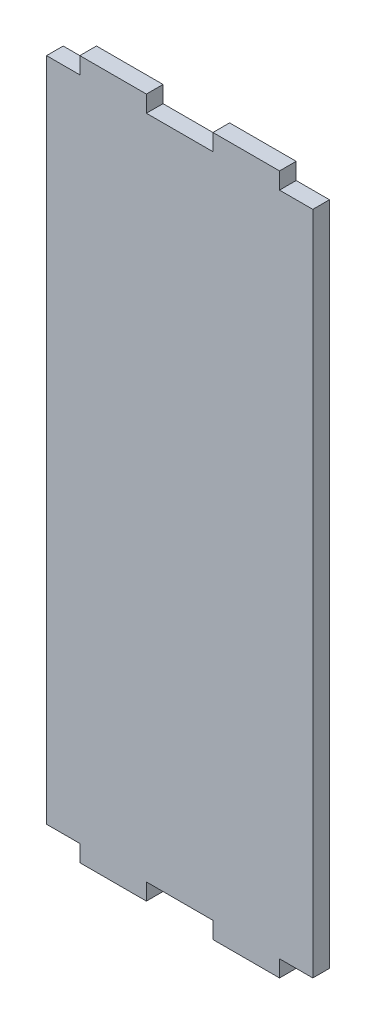
ISO-10303-21;
HEADER;
FILE_DESCRIPTION(('STEP AP214'),'2;1');
FILE_NAME('part.step','',(''),(''),'','','');
FILE_SCHEMA(('AUTOMOTIVE_DESIGN { 1 0 10303 214 1 1 1 1 }'));
ENDSEC;
DATA;
#1=APPLICATION_CONTEXT('core data for automotive mechanical design processes');
#2=APPLICATION_PROTOCOL_DEFINITION('international standard','automotive_design',2000,#1);
#3=PRODUCT_CONTEXT('',#1,'mechanical');
#4=PRODUCT('Part','Part','',(#3));
#5=PRODUCT_RELATED_PRODUCT_CATEGORY('part','',(#4));
#6=PRODUCT_DEFINITION_FORMATION('','',#4);
#7=PRODUCT_DEFINITION_CONTEXT('part definition',#1,'design');
#8=PRODUCT_DEFINITION('design','',#6,#7);
#9=PRODUCT_DEFINITION_SHAPE('','',#8);
#10=(LENGTH_UNIT() NAMED_UNIT(*) SI_UNIT(.MILLI.,.METRE.));
#11=(NAMED_UNIT(*) PLANE_ANGLE_UNIT() SI_UNIT($,.RADIAN.));
#12=(NAMED_UNIT(*) SI_UNIT($,.STERADIAN.) SOLID_ANGLE_UNIT());
#13=UNCERTAINTY_MEASURE_WITH_UNIT(LENGTH_MEASURE(1.E-05),#10,'distance_accuracy_value','');
#14=(GEOMETRIC_REPRESENTATION_CONTEXT(3) GLOBAL_UNCERTAINTY_ASSIGNED_CONTEXT((#13)) GLOBAL_UNIT_ASSIGNED_CONTEXT((#10,
#11,#12)) REPRESENTATION_CONTEXT('',''));
#15=CARTESIAN_POINT('',(0.,0.,0.));
#16=DIRECTION('',(0.,0.,1.));
#17=DIRECTION('',(1.,0.,0.));
#18=AXIS2_PLACEMENT_3D('',#15,#16,#17);
#19=CARTESIAN_POINT('',(0.,0.,5.));
#20=DIRECTION('',(0.,1.,0.));
#21=DIRECTION('',(-1.,0.,0.));
#22=AXIS2_PLACEMENT_3D('',#19,#20,#21);
#23=PLANE('',#22);
#24=DIRECTION('',(1.,0.,0.));
#25=VECTOR('',#24,1.);
#26=CARTESIAN_POINT('',(0.,0.,5.));
#27=LINE('',#26,#25);
#28=CARTESIAN_POINT('',(-10.,0.,5.));
#29=VERTEX_POINT('',#28);
#30=CARTESIAN_POINT('',(0.,0.,5.));
#31=VERTEX_POINT('',#30);
#32=EDGE_CURVE('E49',#29,#31,#27,.T.);
#33=ORIENTED_EDGE('',*,*,#32,.F.);
#34=DIRECTION('',(0.,0.,1.));
#35=VECTOR('',#34,1.);
#36=CARTESIAN_POINT('',(-10.,0.,0.));
#37=LINE('',#36,#35);
#38=CARTESIAN_POINT('',(-10.,0.,0.));
#39=VERTEX_POINT('',#38);
#40=EDGE_CURVE('E205',#39,#29,#37,.T.);
#41=ORIENTED_EDGE('',*,*,#40,.F.);
#42=DIRECTION('',(1.,0.,0.));
#43=VECTOR('',#42,1.);
#44=CARTESIAN_POINT('',(0.,0.,0.));
#45=LINE('',#44,#43);
#46=CARTESIAN_POINT('',(0.,0.,0.));
#47=VERTEX_POINT('',#46);
#48=EDGE_CURVE('E314',#39,#47,#45,.T.);
#49=ORIENTED_EDGE('',*,*,#48,.T.);
#50=DIRECTION('',(0.,0.,-1.));
#51=VECTOR('',#50,1.);
#52=CARTESIAN_POINT('',(0.,0.,5.));
#53=LINE('',#52,#51);
#54=EDGE_CURVE('E303',#31,#47,#53,.T.);
#55=ORIENTED_EDGE('',*,*,#54,.F.);
#56=EDGE_LOOP('',(#33,#41,#49,#55));
#57=FACE_BOUND('',#56,.T.);
#58=ADVANCED_FACE('F34',(#57),#23,.F.);
#59=CARTESIAN_POINT('',(-50.,0.,0.));
#60=VERTEX_POINT('',#59);
#61=CARTESIAN_POINT('',(-30.,0.,0.));
#62=VERTEX_POINT('',#61);
#63=EDGE_CURVE('E317',#60,#62,#45,.T.);
#64=ORIENTED_EDGE('',*,*,#63,.T.);
#65=DIRECTION('',(0.,0.,1.));
#66=VECTOR('',#65,1.);
#67=CARTESIAN_POINT('',(-30.,0.,0.));
#68=LINE('',#67,#66);
#69=CARTESIAN_POINT('',(-30.,0.,5.));
#70=VERTEX_POINT('',#69);
#71=EDGE_CURVE('E57',#62,#70,#68,.T.);
#72=ORIENTED_EDGE('',*,*,#71,.T.);
#73=CARTESIAN_POINT('',(-50.,0.,5.));
#74=VERTEX_POINT('',#73);
#75=EDGE_CURVE('E304',#74,#70,#27,.T.);
#76=ORIENTED_EDGE('',*,*,#75,.F.);
#77=DIRECTION('',(0.,0.,1.));
#78=VECTOR('',#77,1.);
#79=CARTESIAN_POINT('',(-50.,0.,0.));
#80=LINE('',#79,#78);
#81=EDGE_CURVE('E227',#60,#74,#80,.T.);
#82=ORIENTED_EDGE('',*,*,#81,.F.);
#83=EDGE_LOOP('',(#64,#72,#76,#82));
#84=FACE_BOUND('',#83,.T.);
#85=ADVANCED_FACE('F379',(#84),#23,.F.);
#86=CARTESIAN_POINT('',(0.,200.,5.));
#87=DIRECTION('',(0.,-1.,0.));
#88=DIRECTION('',(1.,0.,0.));
#89=AXIS2_PLACEMENT_3D('',#86,#87,#88);
#90=PLANE('',#89);
#91=DIRECTION('',(-1.,0.,0.));
#92=VECTOR('',#91,1.);
#93=CARTESIAN_POINT('',(0.,200.,0.));
#94=LINE('',#93,#92);
#95=CARTESIAN_POINT('',(-30.,200.,0.));
#96=VERTEX_POINT('',#95);
#97=CARTESIAN_POINT('',(-50.,200.,0.));
#98=VERTEX_POINT('',#97);
#99=EDGE_CURVE('E312',#96,#98,#94,.T.);
#100=ORIENTED_EDGE('',*,*,#99,.T.);
#101=DIRECTION('',(0.,0.,1.));
#102=VECTOR('',#101,1.);
#103=CARTESIAN_POINT('',(-50.,200.,0.));
#104=LINE('',#103,#102);
#105=CARTESIAN_POINT('',(-50.,200.,5.));
#106=VERTEX_POINT('',#105);
#107=EDGE_CURVE('E254',#98,#106,#104,.T.);
#108=ORIENTED_EDGE('',*,*,#107,.T.);
#109=DIRECTION('',(-1.,0.,0.));
#110=VECTOR('',#109,1.);
#111=CARTESIAN_POINT('',(0.,200.,5.));
#112=LINE('',#111,#110);
#113=CARTESIAN_POINT('',(-30.,200.,5.));
#114=VERTEX_POINT('',#113);
#115=EDGE_CURVE('E298',#114,#106,#112,.T.);
#116=ORIENTED_EDGE('',*,*,#115,.F.);
#117=DIRECTION('',(0.,0.,1.));
#118=VECTOR('',#117,1.);
#119=CARTESIAN_POINT('',(-30.,200.,0.));
#120=LINE('',#119,#118);
#121=EDGE_CURVE('E284',#96,#114,#120,.T.);
#122=ORIENTED_EDGE('',*,*,#121,.F.);
#123=EDGE_LOOP('',(#100,#108,#116,#122));
#124=FACE_BOUND('',#123,.T.);
#125=ADVANCED_FACE('F359',(#124),#90,.F.);
#126=CARTESIAN_POINT('',(-70.,200.,5.));
#127=VERTEX_POINT('',#126);
#128=CARTESIAN_POINT('',(-80.,200.,5.));
#129=VERTEX_POINT('',#128);
#130=EDGE_CURVE('E292',#127,#129,#112,.T.);
#131=ORIENTED_EDGE('',*,*,#130,.F.);
#132=DIRECTION('',(0.,0.,1.));
#133=VECTOR('',#132,1.);
#134=CARTESIAN_POINT('',(-70.,200.,0.));
#135=LINE('',#134,#133);
#136=CARTESIAN_POINT('',(-70.,200.,0.));
#137=VERTEX_POINT('',#136);
#138=EDGE_CURVE('E257',#137,#127,#135,.T.);
#139=ORIENTED_EDGE('',*,*,#138,.F.);
#140=CARTESIAN_POINT('',(-80.,200.,0.));
#141=VERTEX_POINT('',#140);
#142=EDGE_CURVE('E307',#137,#141,#94,.T.);
#143=ORIENTED_EDGE('',*,*,#142,.T.);
#144=DIRECTION('',(0.,0.,-1.));
#145=VECTOR('',#144,1.);
#146=CARTESIAN_POINT('',(-80.,200.,5.));
#147=LINE('',#146,#145);
#148=EDGE_CURVE('E42',#129,#141,#147,.T.);
#149=ORIENTED_EDGE('',*,*,#148,.F.);
#150=EDGE_LOOP('',(#131,#139,#143,#149));
#151=FACE_BOUND('',#150,.T.);
#152=ADVANCED_FACE('F357',(#151),#90,.F.);
#153=CARTESIAN_POINT('',(0.,0.,5.));
#154=DIRECTION('',(-1.,0.,0.));
#155=DIRECTION('',(0.,0.,1.));
#156=AXIS2_PLACEMENT_3D('',#153,#154,#155);
#157=PLANE('',#156);
#158=DIRECTION('',(0.,1.,0.));
#159=VECTOR('',#158,1.);
#160=CARTESIAN_POINT('',(0.,0.,0.));
#161=LINE('',#160,#159);
#162=CARTESIAN_POINT('',(0.,200.,0.));
#163=VERTEX_POINT('',#162);
#164=EDGE_CURVE('E283',#47,#163,#161,.T.);
#165=ORIENTED_EDGE('',*,*,#164,.T.);
#166=DIRECTION('',(0.,0.,-1.));
#167=VECTOR('',#166,1.);
#168=CARTESIAN_POINT('',(0.,200.,5.));
#169=LINE('',#168,#167);
#170=CARTESIAN_POINT('',(0.,200.,5.));
#171=VERTEX_POINT('',#170);
#172=EDGE_CURVE('E11',#171,#163,#169,.T.);
#173=ORIENTED_EDGE('',*,*,#172,.F.);
#174=DIRECTION('',(0.,1.,0.));
#175=VECTOR('',#174,1.);
#176=CARTESIAN_POINT('',(0.,0.,5.));
#177=LINE('',#176,#175);
#178=EDGE_CURVE('E289',#31,#171,#177,.T.);
#179=ORIENTED_EDGE('',*,*,#178,.F.);
#180=ORIENTED_EDGE('',*,*,#54,.T.);
#181=EDGE_LOOP('',(#165,#173,#179,#180));
#182=FACE_BOUND('',#181,.T.);
#183=ADVANCED_FACE('F36',(#182),#157,.F.);
#184=CARTESIAN_POINT('',(-10.,200.,0.));
#185=VERTEX_POINT('',#184);
#186=EDGE_CURVE('E308',#163,#185,#94,.T.);
#187=ORIENTED_EDGE('',*,*,#186,.T.);
#188=DIRECTION('',(0.,0.,1.));
#189=VECTOR('',#188,1.);
#190=CARTESIAN_POINT('',(-10.,200.,0.));
#191=LINE('',#190,#189);
#192=CARTESIAN_POINT('',(-10.,200.,5.));
#193=VERTEX_POINT('',#192);
#194=EDGE_CURVE('E280',#185,#193,#191,.T.);
#195=ORIENTED_EDGE('',*,*,#194,.T.);
#196=EDGE_CURVE('E294',#171,#193,#112,.T.);
#197=ORIENTED_EDGE('',*,*,#196,.F.);
#198=ORIENTED_EDGE('',*,*,#172,.T.);
#199=EDGE_LOOP('',(#187,#195,#197,#198));
#200=FACE_BOUND('',#199,.T.);
#201=ADVANCED_FACE('F370',(#200),#90,.F.);
#202=CARTESIAN_POINT('',(-80.,0.,5.));
#203=DIRECTION('',(1.,0.,0.));
#204=DIRECTION('',(0.,0.,-1.));
#205=AXIS2_PLACEMENT_3D('',#202,#203,#204);
#206=PLANE('',#205);
#207=DIRECTION('',(0.,-1.,0.));
#208=VECTOR('',#207,1.);
#209=CARTESIAN_POINT('',(-80.,0.,0.));
#210=LINE('',#209,#208);
#211=CARTESIAN_POINT('',(-80.,0.,0.));
#212=VERTEX_POINT('',#211);
#213=EDGE_CURVE('E311',#141,#212,#210,.T.);
#214=ORIENTED_EDGE('',*,*,#213,.T.);
#215=DIRECTION('',(0.,0.,-1.));
#216=VECTOR('',#215,1.);
#217=CARTESIAN_POINT('',(-80.,0.,5.));
#218=LINE('',#217,#216);
#219=CARTESIAN_POINT('',(-80.,0.,5.));
#220=VERTEX_POINT('',#219);
#221=EDGE_CURVE('E320',#220,#212,#218,.T.);
#222=ORIENTED_EDGE('',*,*,#221,.F.);
#223=DIRECTION('',(0.,-1.,0.));
#224=VECTOR('',#223,1.);
#225=CARTESIAN_POINT('',(-80.,0.,5.));
#226=LINE('',#225,#224);
#227=EDGE_CURVE('E297',#129,#220,#226,.T.);
#228=ORIENTED_EDGE('',*,*,#227,.F.);
#229=ORIENTED_EDGE('',*,*,#148,.T.);
#230=EDGE_LOOP('',(#214,#222,#228,#229));
#231=FACE_BOUND('',#230,.T.);
#232=ADVANCED_FACE('F327',(#231),#206,.F.);
#233=CARTESIAN_POINT('',(-70.,0.,0.));
#234=VERTEX_POINT('',#233);
#235=EDGE_CURVE('E293',#212,#234,#45,.T.);
#236=ORIENTED_EDGE('',*,*,#235,.T.);
#237=DIRECTION('',(0.,0.,1.));
#238=VECTOR('',#237,1.);
#239=CARTESIAN_POINT('',(-70.,0.,0.));
#240=LINE('',#239,#238);
#241=CARTESIAN_POINT('',(-70.,0.,5.));
#242=VERTEX_POINT('',#241);
#243=EDGE_CURVE('E219',#234,#242,#240,.T.);
#244=ORIENTED_EDGE('',*,*,#243,.T.);
#245=EDGE_CURVE('E300',#220,#242,#27,.T.);
#246=ORIENTED_EDGE('',*,*,#245,.F.);
#247=ORIENTED_EDGE('',*,*,#221,.T.);
#248=EDGE_LOOP('',(#236,#244,#246,#247));
#249=FACE_BOUND('',#248,.T.);
#250=ADVANCED_FACE('F336',(#249),#23,.F.);
#251=CARTESIAN_POINT('',(0.,0.,5.));
#252=DIRECTION('',(0.,0.,1.));
#253=DIRECTION('',(1.,0.,0.));
#254=AXIS2_PLACEMENT_3D('',#251,#252,#253);
#255=PLANE('',#254);
#256=ORIENTED_EDGE('',*,*,#178,.T.);
#257=ORIENTED_EDGE('',*,*,#196,.T.);
#258=DIRECTION('',(0.,1.,0.));
#259=VECTOR('',#258,1.);
#260=CARTESIAN_POINT('',(-10.,200.,5.));
#261=LINE('',#260,#259);
#262=CARTESIAN_POINT('',(-10.,205.,5.));
#263=VERTEX_POINT('',#262);
#264=EDGE_CURVE('E256',#193,#263,#261,.T.);
#265=ORIENTED_EDGE('',*,*,#264,.T.);
#266=DIRECTION('',(-1.,0.,0.));
#267=VECTOR('',#266,1.);
#268=CARTESIAN_POINT('',(-10.,205.,5.));
#269=LINE('',#268,#267);
#270=CARTESIAN_POINT('',(-30.,205.,5.));
#271=VERTEX_POINT('',#270);
#272=EDGE_CURVE('E275',#263,#271,#269,.T.);
#273=ORIENTED_EDGE('',*,*,#272,.T.);
#274=DIRECTION('',(0.,-1.,0.));
#275=VECTOR('',#274,1.);
#276=CARTESIAN_POINT('',(-30.,200.,5.));
#277=LINE('',#276,#275);
#278=EDGE_CURVE('E267',#271,#114,#277,.T.);
#279=ORIENTED_EDGE('',*,*,#278,.T.);
#280=ORIENTED_EDGE('',*,*,#115,.T.);
#281=DIRECTION('',(0.,1.,0.));
#282=VECTOR('',#281,1.);
#283=CARTESIAN_POINT('',(-50.,200.,5.));
#284=LINE('',#283,#282);
#285=CARTESIAN_POINT('',(-50.,205.,5.));
#286=VERTEX_POINT('',#285);
#287=EDGE_CURVE('E229',#106,#286,#284,.T.);
#288=ORIENTED_EDGE('',*,*,#287,.T.);
#289=DIRECTION('',(-1.,0.,0.));
#290=VECTOR('',#289,1.);
#291=CARTESIAN_POINT('',(-50.,205.,5.));
#292=LINE('',#291,#290);
#293=CARTESIAN_POINT('',(-70.,205.,5.));
#294=VERTEX_POINT('',#293);
#295=EDGE_CURVE('E249',#286,#294,#292,.T.);
#296=ORIENTED_EDGE('',*,*,#295,.T.);
#297=DIRECTION('',(0.,-1.,0.));
#298=VECTOR('',#297,1.);
#299=CARTESIAN_POINT('',(-70.,200.,5.));
#300=LINE('',#299,#298);
#301=EDGE_CURVE('E240',#294,#127,#300,.T.);
#302=ORIENTED_EDGE('',*,*,#301,.T.);
#303=ORIENTED_EDGE('',*,*,#130,.T.);
#304=ORIENTED_EDGE('',*,*,#227,.T.);
#305=ORIENTED_EDGE('',*,*,#245,.T.);
#306=DIRECTION('',(0.,-1.,0.));
#307=VECTOR('',#306,1.);
#308=CARTESIAN_POINT('',(-70.,0.,5.));
#309=LINE('',#308,#307);
#310=CARTESIAN_POINT('',(-70.,-5.,5.));
#311=VERTEX_POINT('',#310);
#312=EDGE_CURVE('E207',#242,#311,#309,.T.);
#313=ORIENTED_EDGE('',*,*,#312,.T.);
#314=DIRECTION('',(1.,0.,0.));
#315=VECTOR('',#314,1.);
#316=CARTESIAN_POINT('',(-50.,-5.,5.));
#317=LINE('',#316,#315);
#318=CARTESIAN_POINT('',(-50.,-5.,5.));
#319=VERTEX_POINT('',#318);
#320=EDGE_CURVE('E222',#311,#319,#317,.T.);
#321=ORIENTED_EDGE('',*,*,#320,.T.);
#322=DIRECTION('',(0.,1.,0.));
#323=VECTOR('',#322,1.);
#324=CARTESIAN_POINT('',(-50.,0.,5.));
#325=LINE('',#324,#323);
#326=EDGE_CURVE('E214',#319,#74,#325,.T.);
#327=ORIENTED_EDGE('',*,*,#326,.T.);
#328=ORIENTED_EDGE('',*,*,#75,.T.);
#329=DIRECTION('',(0.,-1.,0.));
#330=VECTOR('',#329,1.);
#331=CARTESIAN_POINT('',(-30.,0.,5.));
#332=LINE('',#331,#330);
#333=CARTESIAN_POINT('',(-30.,-5.,5.));
#334=VERTEX_POINT('',#333);
#335=EDGE_CURVE('E202',#70,#334,#332,.T.);
#336=ORIENTED_EDGE('',*,*,#335,.T.);
#337=DIRECTION('',(1.,0.,0.));
#338=VECTOR('',#337,1.);
#339=CARTESIAN_POINT('',(-10.,-5.,5.));
#340=LINE('',#339,#338);
#341=CARTESIAN_POINT('',(-10.,-5.,5.));
#342=VERTEX_POINT('',#341);
#343=EDGE_CURVE('E179',#334,#342,#340,.T.);
#344=ORIENTED_EDGE('',*,*,#343,.T.);
#345=DIRECTION('',(0.,1.,0.));
#346=VECTOR('',#345,1.);
#347=CARTESIAN_POINT('',(-10.,0.,5.));
#348=LINE('',#347,#346);
#349=EDGE_CURVE('E196',#342,#29,#348,.T.);
#350=ORIENTED_EDGE('',*,*,#349,.T.);
#351=ORIENTED_EDGE('',*,*,#32,.T.);
#352=EDGE_LOOP('',(#256,#257,#265,#273,#279,#280,#288,#296,#302,#303,#304,#305,#313,#321,#327,
#328,#336,#344,#350,#351));
#353=FACE_BOUND('',#352,.T.);
#354=ADVANCED_FACE('F339',(#353),#255,.T.);
#355=CARTESIAN_POINT('',(0.,0.,0.));
#356=DIRECTION('',(0.,0.,1.));
#357=DIRECTION('',(1.,0.,0.));
#358=AXIS2_PLACEMENT_3D('',#355,#356,#357);
#359=PLANE('',#358);
#360=ORIENTED_EDGE('',*,*,#164,.F.);
#361=ORIENTED_EDGE('',*,*,#48,.F.);
#362=DIRECTION('',(0.,1.,0.));
#363=VECTOR('',#362,1.);
#364=CARTESIAN_POINT('',(-10.,0.,0.));
#365=LINE('',#364,#363);
#366=CARTESIAN_POINT('',(-10.,-5.,0.));
#367=VERTEX_POINT('',#366);
#368=EDGE_CURVE('E193',#367,#39,#365,.T.);
#369=ORIENTED_EDGE('',*,*,#368,.F.);
#370=DIRECTION('',(1.,0.,0.));
#371=VECTOR('',#370,1.);
#372=CARTESIAN_POINT('',(-10.,-5.,0.));
#373=LINE('',#372,#371);
#374=CARTESIAN_POINT('',(-30.,-5.,0.));
#375=VERTEX_POINT('',#374);
#376=EDGE_CURVE('E176',#375,#367,#373,.T.);
#377=ORIENTED_EDGE('',*,*,#376,.F.);
#378=DIRECTION('',(0.,-1.,0.));
#379=VECTOR('',#378,1.);
#380=CARTESIAN_POINT('',(-30.,0.,0.));
#381=LINE('',#380,#379);
#382=EDGE_CURVE('E191',#62,#375,#381,.T.);
#383=ORIENTED_EDGE('',*,*,#382,.F.);
#384=ORIENTED_EDGE('',*,*,#63,.F.);
#385=DIRECTION('',(0.,1.,0.));
#386=VECTOR('',#385,1.);
#387=CARTESIAN_POINT('',(-50.,0.,0.));
#388=LINE('',#387,#386);
#389=CARTESIAN_POINT('',(-50.,-5.,0.));
#390=VERTEX_POINT('',#389);
#391=EDGE_CURVE('E217',#390,#60,#388,.T.);
#392=ORIENTED_EDGE('',*,*,#391,.F.);
#393=DIRECTION('',(1.,0.,0.));
#394=VECTOR('',#393,1.);
#395=CARTESIAN_POINT('',(-50.,-5.,0.));
#396=LINE('',#395,#394);
#397=CARTESIAN_POINT('',(-70.,-5.,0.));
#398=VERTEX_POINT('',#397);
#399=EDGE_CURVE('E213',#398,#390,#396,.T.);
#400=ORIENTED_EDGE('',*,*,#399,.F.);
#401=DIRECTION('',(0.,-1.,0.));
#402=VECTOR('',#401,1.);
#403=CARTESIAN_POINT('',(-70.,0.,0.));
#404=LINE('',#403,#402);
#405=EDGE_CURVE('E210',#234,#398,#404,.T.);
#406=ORIENTED_EDGE('',*,*,#405,.F.);
#407=ORIENTED_EDGE('',*,*,#235,.F.);
#408=ORIENTED_EDGE('',*,*,#213,.F.);
#409=ORIENTED_EDGE('',*,*,#142,.F.);
#410=DIRECTION('',(0.,-1.,0.));
#411=VECTOR('',#410,1.);
#412=CARTESIAN_POINT('',(-70.,200.,0.));
#413=LINE('',#412,#411);
#414=CARTESIAN_POINT('',(-70.,205.,0.));
#415=VERTEX_POINT('',#414);
#416=EDGE_CURVE('E243',#415,#137,#413,.T.);
#417=ORIENTED_EDGE('',*,*,#416,.F.);
#418=DIRECTION('',(-1.,0.,0.));
#419=VECTOR('',#418,1.);
#420=CARTESIAN_POINT('',(-50.,205.,0.));
#421=LINE('',#420,#419);
#422=CARTESIAN_POINT('',(-50.,205.,0.));
#423=VERTEX_POINT('',#422);
#424=EDGE_CURVE('E239',#423,#415,#421,.T.);
#425=ORIENTED_EDGE('',*,*,#424,.F.);
#426=DIRECTION('',(0.,1.,0.));
#427=VECTOR('',#426,1.);
#428=CARTESIAN_POINT('',(-50.,200.,0.));
#429=LINE('',#428,#427);
#430=EDGE_CURVE('E236',#98,#423,#429,.T.);
#431=ORIENTED_EDGE('',*,*,#430,.F.);
#432=ORIENTED_EDGE('',*,*,#99,.F.);
#433=DIRECTION('',(0.,-1.,0.));
#434=VECTOR('',#433,1.);
#435=CARTESIAN_POINT('',(-30.,200.,0.));
#436=LINE('',#435,#434);
#437=CARTESIAN_POINT('',(-30.,205.,0.));
#438=VERTEX_POINT('',#437);
#439=EDGE_CURVE('E270',#438,#96,#436,.T.);
#440=ORIENTED_EDGE('',*,*,#439,.F.);
#441=DIRECTION('',(-1.,0.,0.));
#442=VECTOR('',#441,1.);
#443=CARTESIAN_POINT('',(-10.,205.,0.));
#444=LINE('',#443,#442);
#445=CARTESIAN_POINT('',(-10.,205.,0.));
#446=VERTEX_POINT('',#445);
#447=EDGE_CURVE('E266',#446,#438,#444,.T.);
#448=ORIENTED_EDGE('',*,*,#447,.F.);
#449=DIRECTION('',(0.,1.,0.));
#450=VECTOR('',#449,1.);
#451=CARTESIAN_POINT('',(-10.,200.,0.));
#452=LINE('',#451,#450);
#453=EDGE_CURVE('E263',#185,#446,#452,.T.);
#454=ORIENTED_EDGE('',*,*,#453,.F.);
#455=ORIENTED_EDGE('',*,*,#186,.F.);
#456=EDGE_LOOP('',(#360,#361,#369,#377,#383,#384,#392,#400,#406,#407,#408,#409,#417,#425,#431,
#432,#440,#448,#454,#455));
#457=FACE_BOUND('',#456,.T.);
#458=ADVANCED_FACE('F189',(#457),#359,.F.);
#459=CARTESIAN_POINT('',(-10.,200.,0.));
#460=DIRECTION('',(1.,0.,0.));
#461=DIRECTION('',(0.,0.,-1.));
#462=AXIS2_PLACEMENT_3D('',#459,#460,#461);
#463=PLANE('',#462);
#464=ORIENTED_EDGE('',*,*,#264,.F.);
#465=ORIENTED_EDGE('',*,*,#194,.F.);
#466=ORIENTED_EDGE('',*,*,#453,.T.);
#467=DIRECTION('',(0.,0.,1.));
#468=VECTOR('',#467,1.);
#469=CARTESIAN_POINT('',(-10.,205.,0.));
#470=LINE('',#469,#468);
#471=EDGE_CURVE('E272',#446,#263,#470,.T.);
#472=ORIENTED_EDGE('',*,*,#471,.T.);
#473=EDGE_LOOP('',(#464,#465,#466,#472));
#474=FACE_BOUND('',#473,.T.);
#475=ADVANCED_FACE('F368',(#474),#463,.T.);
#476=CARTESIAN_POINT('',(-30.,200.,0.));
#477=DIRECTION('',(-1.,0.,0.));
#478=DIRECTION('',(0.,0.,1.));
#479=AXIS2_PLACEMENT_3D('',#476,#477,#478);
#480=PLANE('',#479);
#481=ORIENTED_EDGE('',*,*,#278,.F.);
#482=DIRECTION('',(0.,0.,1.));
#483=VECTOR('',#482,1.);
#484=CARTESIAN_POINT('',(-30.,205.,0.));
#485=LINE('',#484,#483);
#486=EDGE_CURVE('E286',#438,#271,#485,.T.);
#487=ORIENTED_EDGE('',*,*,#486,.F.);
#488=ORIENTED_EDGE('',*,*,#439,.T.);
#489=ORIENTED_EDGE('',*,*,#121,.T.);
#490=EDGE_LOOP('',(#481,#487,#488,#489));
#491=FACE_BOUND('',#490,.T.);
#492=ADVANCED_FACE('F490',(#491),#480,.T.);
#493=CARTESIAN_POINT('',(-10.,205.,0.));
#494=DIRECTION('',(0.,1.,0.));
#495=DIRECTION('',(0.,0.,1.));
#496=AXIS2_PLACEMENT_3D('',#493,#494,#495);
#497=PLANE('',#496);
#498=ORIENTED_EDGE('',*,*,#272,.F.);
#499=ORIENTED_EDGE('',*,*,#471,.F.);
#500=ORIENTED_EDGE('',*,*,#447,.T.);
#501=ORIENTED_EDGE('',*,*,#486,.T.);
#502=EDGE_LOOP('',(#498,#499,#500,#501));
#503=FACE_BOUND('',#502,.T.);
#504=ADVANCED_FACE('F366',(#503),#497,.T.);
#505=CARTESIAN_POINT('',(-50.,200.,0.));
#506=DIRECTION('',(1.,0.,0.));
#507=DIRECTION('',(0.,1.,0.));
#508=AXIS2_PLACEMENT_3D('',#505,#506,#507);
#509=PLANE('',#508);
#510=ORIENTED_EDGE('',*,*,#287,.F.);
#511=ORIENTED_EDGE('',*,*,#107,.F.);
#512=ORIENTED_EDGE('',*,*,#430,.T.);
#513=DIRECTION('',(0.,0.,1.));
#514=VECTOR('',#513,1.);
#515=CARTESIAN_POINT('',(-50.,205.,0.));
#516=LINE('',#515,#514);
#517=EDGE_CURVE('E246',#423,#286,#516,.T.);
#518=ORIENTED_EDGE('',*,*,#517,.T.);
#519=EDGE_LOOP('',(#510,#511,#512,#518));
#520=FACE_BOUND('',#519,.T.);
#521=ADVANCED_FACE('F349',(#520),#509,.T.);
#522=CARTESIAN_POINT('',(-70.,200.,0.));
#523=DIRECTION('',(-1.,0.,0.));
#524=DIRECTION('',(0.,0.,1.));
#525=AXIS2_PLACEMENT_3D('',#522,#523,#524);
#526=PLANE('',#525);
#527=ORIENTED_EDGE('',*,*,#301,.F.);
#528=DIRECTION('',(0.,0.,1.));
#529=VECTOR('',#528,1.);
#530=CARTESIAN_POINT('',(-70.,205.,0.));
#531=LINE('',#530,#529);
#532=EDGE_CURVE('E260',#415,#294,#531,.T.);
#533=ORIENTED_EDGE('',*,*,#532,.F.);
#534=ORIENTED_EDGE('',*,*,#416,.T.);
#535=ORIENTED_EDGE('',*,*,#138,.T.);
#536=EDGE_LOOP('',(#527,#533,#534,#535));
#537=FACE_BOUND('',#536,.T.);
#538=ADVANCED_FACE('F356',(#537),#526,.T.);
#539=CARTESIAN_POINT('',(-50.,205.,0.));
#540=DIRECTION('',(0.,1.,0.));
#541=DIRECTION('',(0.,0.,1.));
#542=AXIS2_PLACEMENT_3D('',#539,#540,#541);
#543=PLANE('',#542);
#544=ORIENTED_EDGE('',*,*,#295,.F.);
#545=ORIENTED_EDGE('',*,*,#517,.F.);
#546=ORIENTED_EDGE('',*,*,#424,.T.);
#547=ORIENTED_EDGE('',*,*,#532,.T.);
#548=EDGE_LOOP('',(#544,#545,#546,#547));
#549=FACE_BOUND('',#548,.T.);
#550=ADVANCED_FACE('F354',(#549),#543,.T.);
#551=CARTESIAN_POINT('',(-50.,0.,0.));
#552=DIRECTION('',(1.,0.,0.));
#553=DIRECTION('',(0.,1.,0.));
#554=AXIS2_PLACEMENT_3D('',#551,#552,#553);
#555=PLANE('',#554);
#556=ORIENTED_EDGE('',*,*,#326,.F.);
#557=DIRECTION('',(0.,0.,1.));
#558=VECTOR('',#557,1.);
#559=CARTESIAN_POINT('',(-50.,-5.,0.));
#560=LINE('',#559,#558);
#561=EDGE_CURVE('E230',#390,#319,#560,.T.);
#562=ORIENTED_EDGE('',*,*,#561,.F.);
#563=ORIENTED_EDGE('',*,*,#391,.T.);
#564=ORIENTED_EDGE('',*,*,#81,.T.);
#565=EDGE_LOOP('',(#556,#562,#563,#564));
#566=FACE_BOUND('',#565,.T.);
#567=ADVANCED_FACE('F382',(#566),#555,.T.);
#568=CARTESIAN_POINT('',(-50.,-5.,0.));
#569=DIRECTION('',(0.,-1.,0.));
#570=DIRECTION('',(0.,0.,-1.));
#571=AXIS2_PLACEMENT_3D('',#568,#569,#570);
#572=PLANE('',#571);
#573=ORIENTED_EDGE('',*,*,#320,.F.);
#574=DIRECTION('',(0.,0.,1.));
#575=VECTOR('',#574,1.);
#576=CARTESIAN_POINT('',(-70.,-5.,0.));
#577=LINE('',#576,#575);
#578=EDGE_CURVE('E232',#398,#311,#577,.T.);
#579=ORIENTED_EDGE('',*,*,#578,.F.);
#580=ORIENTED_EDGE('',*,*,#399,.T.);
#581=ORIENTED_EDGE('',*,*,#561,.T.);
#582=EDGE_LOOP('',(#573,#579,#580,#581));
#583=FACE_BOUND('',#582,.T.);
#584=ADVANCED_FACE('F385',(#583),#572,.T.);
#585=CARTESIAN_POINT('',(-70.,0.,0.));
#586=DIRECTION('',(-1.,0.,0.));
#587=DIRECTION('',(0.,0.,1.));
#588=AXIS2_PLACEMENT_3D('',#585,#586,#587);
#589=PLANE('',#588);
#590=ORIENTED_EDGE('',*,*,#312,.F.);
#591=ORIENTED_EDGE('',*,*,#243,.F.);
#592=ORIENTED_EDGE('',*,*,#405,.T.);
#593=ORIENTED_EDGE('',*,*,#578,.T.);
#594=EDGE_LOOP('',(#590,#591,#592,#593));
#595=FACE_BOUND('',#594,.T.);
#596=ADVANCED_FACE('F387',(#595),#589,.T.);
#597=CARTESIAN_POINT('',(-10.,0.,0.));
#598=DIRECTION('',(1.,0.,0.));
#599=DIRECTION('',(0.,0.,-1.));
#600=AXIS2_PLACEMENT_3D('',#597,#598,#599);
#601=PLANE('',#600);
#602=ORIENTED_EDGE('',*,*,#349,.F.);
#603=DIRECTION('',(0.,0.,1.));
#604=VECTOR('',#603,1.);
#605=CARTESIAN_POINT('',(-10.,-5.,0.));
#606=LINE('',#605,#604);
#607=EDGE_CURVE('E184',#367,#342,#606,.T.);
#608=ORIENTED_EDGE('',*,*,#607,.F.);
#609=ORIENTED_EDGE('',*,*,#368,.T.);
#610=ORIENTED_EDGE('',*,*,#40,.T.);
#611=EDGE_LOOP('',(#602,#608,#609,#610));
#612=FACE_BOUND('',#611,.T.);
#613=ADVANCED_FACE('F376',(#612),#601,.T.);
#614=CARTESIAN_POINT('',(-10.,-5.,0.));
#615=DIRECTION('',(0.,-1.,0.));
#616=DIRECTION('',(0.,0.,-1.));
#617=AXIS2_PLACEMENT_3D('',#614,#615,#616);
#618=PLANE('',#617);
#619=ORIENTED_EDGE('',*,*,#343,.F.);
#620=DIRECTION('',(0.,0.,1.));
#621=VECTOR('',#620,1.);
#622=CARTESIAN_POINT('',(-30.,-5.,0.));
#623=LINE('',#622,#621);
#624=EDGE_CURVE('E173',#375,#334,#623,.T.);
#625=ORIENTED_EDGE('',*,*,#624,.F.);
#626=ORIENTED_EDGE('',*,*,#376,.T.);
#627=ORIENTED_EDGE('',*,*,#607,.T.);
#628=EDGE_LOOP('',(#619,#625,#626,#627));
#629=FACE_BOUND('',#628,.T.);
#630=ADVANCED_FACE('F175',(#629),#618,.T.);
#631=CARTESIAN_POINT('',(-30.,0.,0.));
#632=DIRECTION('',(-1.,0.,0.));
#633=DIRECTION('',(0.,0.,1.));
#634=AXIS2_PLACEMENT_3D('',#631,#632,#633);
#635=PLANE('',#634);
#636=ORIENTED_EDGE('',*,*,#335,.F.);
#637=ORIENTED_EDGE('',*,*,#71,.F.);
#638=ORIENTED_EDGE('',*,*,#382,.T.);
#639=ORIENTED_EDGE('',*,*,#624,.T.);
#640=EDGE_LOOP('',(#636,#637,#638,#639));
#641=FACE_BOUND('',#640,.T.);
#642=ADVANCED_FACE('F195',(#641),#635,.T.);
#643=CLOSED_SHELL('',(#58,#85,#125,#152,#183,#201,#232,#250,#354,#458,#475,#492,#504,#521,#538,
#550,#567,#584,#596,#613,#630,#642));
#644=MANIFOLD_SOLID_BREP('B2',#643);
#645=ADVANCED_BREP_SHAPE_REPRESENTATION('',(#18,#644),#14);
#646=SHAPE_DEFINITION_REPRESENTATION(#9,#645);
ENDSEC;
END-ISO-10303-21;
